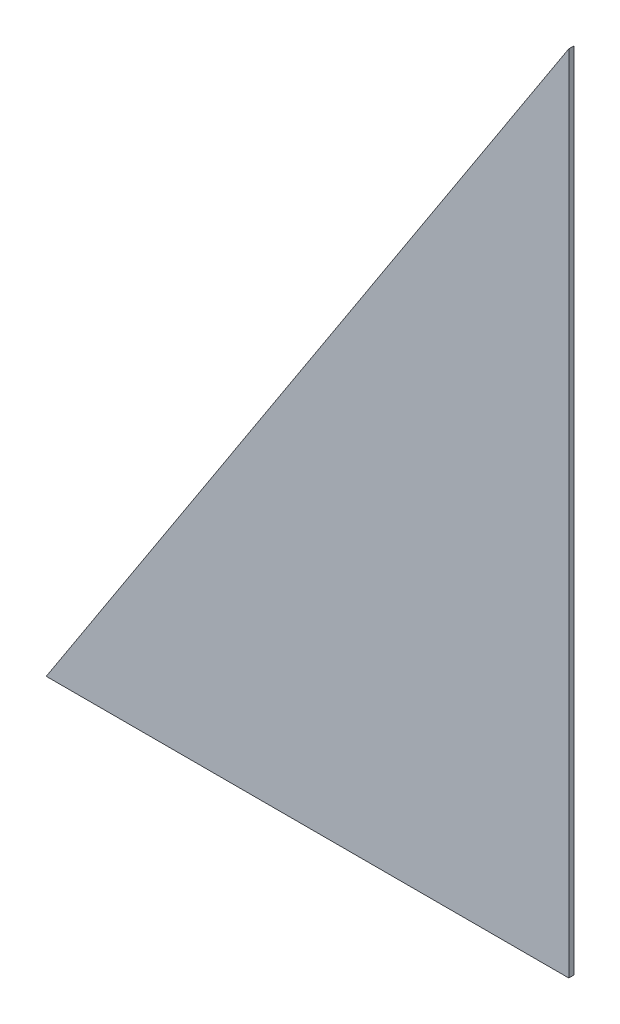
ISO-10303-21;
HEADER;
FILE_DESCRIPTION(('STEP AP214'),'2;1');
FILE_NAME('part.step','',(''),(''),'','','');
FILE_SCHEMA(('AUTOMOTIVE_DESIGN { 1 0 10303 214 1 1 1 1 }'));
ENDSEC;
DATA;
#1=APPLICATION_CONTEXT('core data for automotive mechanical design processes');
#2=APPLICATION_PROTOCOL_DEFINITION('international standard','automotive_design',2000,#1);
#3=PRODUCT_CONTEXT('',#1,'mechanical');
#4=PRODUCT('Part','Part','',(#3));
#5=PRODUCT_RELATED_PRODUCT_CATEGORY('part','',(#4));
#6=PRODUCT_DEFINITION_FORMATION('','',#4);
#7=PRODUCT_DEFINITION_CONTEXT('part definition',#1,'design');
#8=PRODUCT_DEFINITION('design','',#6,#7);
#9=PRODUCT_DEFINITION_SHAPE('','',#8);
#10=(LENGTH_UNIT() NAMED_UNIT(*) SI_UNIT(.MILLI.,.METRE.));
#11=(NAMED_UNIT(*) PLANE_ANGLE_UNIT() SI_UNIT($,.RADIAN.));
#12=(NAMED_UNIT(*) SI_UNIT($,.STERADIAN.) SOLID_ANGLE_UNIT());
#13=UNCERTAINTY_MEASURE_WITH_UNIT(LENGTH_MEASURE(1.E-05),#10,'distance_accuracy_value','');
#14=(GEOMETRIC_REPRESENTATION_CONTEXT(3) GLOBAL_UNCERTAINTY_ASSIGNED_CONTEXT((#13)) GLOBAL_UNIT_ASSIGNED_CONTEXT((#10,
#11,#12)) REPRESENTATION_CONTEXT('',''));
#15=CARTESIAN_POINT('',(0.,0.,0.));
#16=DIRECTION('',(0.,0.,1.));
#17=DIRECTION('',(1.,0.,0.));
#18=AXIS2_PLACEMENT_3D('',#15,#16,#17);
#19=CARTESIAN_POINT('',(0.,0.,0.));
#20=DIRECTION('',(0.,-1.,0.));
#21=DIRECTION('',(1.,0.,0.));
#22=AXIS2_PLACEMENT_3D('',#19,#20,#21);
#23=PLANE('',#22);
#24=DIRECTION('',(-1.,0.,0.));
#25=VECTOR('',#24,1.);
#26=CARTESIAN_POINT('',(0.,0.,1.5875));
#27=LINE('',#26,#25);
#28=CARTESIAN_POINT('',(0.,0.,1.5875));
#29=VERTEX_POINT('',#28);
#30=CARTESIAN_POINT('',(-165.1,0.,1.5875));
#31=VERTEX_POINT('',#30);
#32=EDGE_CURVE('E9',#29,#31,#27,.T.);
#33=ORIENTED_EDGE('',*,*,#32,.T.);
#34=DIRECTION('',(0.,0.,1.));
#35=VECTOR('',#34,1.);
#36=CARTESIAN_POINT('',(-165.1,0.,0.));
#37=LINE('',#36,#35);
#38=CARTESIAN_POINT('',(-165.1,0.,0.));
#39=VERTEX_POINT('',#38);
#40=EDGE_CURVE('E34',#39,#31,#37,.T.);
#41=ORIENTED_EDGE('',*,*,#40,.F.);
#42=DIRECTION('',(-1.,0.,0.));
#43=VECTOR('',#42,1.);
#44=CARTESIAN_POINT('',(0.,0.,0.));
#45=LINE('',#44,#43);
#46=CARTESIAN_POINT('',(0.,0.,0.));
#47=VERTEX_POINT('',#46);
#48=EDGE_CURVE('E54',#47,#39,#45,.T.);
#49=ORIENTED_EDGE('',*,*,#48,.F.);
#50=DIRECTION('',(0.,0.,1.));
#51=VECTOR('',#50,1.);
#52=CARTESIAN_POINT('',(0.,0.,0.));
#53=LINE('',#52,#51);
#54=EDGE_CURVE('E25',#47,#29,#53,.T.);
#55=ORIENTED_EDGE('',*,*,#54,.T.);
#56=EDGE_LOOP('',(#33,#41,#49,#55));
#57=FACE_BOUND('',#56,.T.);
#58=ADVANCED_FACE('F15',(#57),#23,.T.);
#59=CARTESIAN_POINT('',(-165.1,0.,0.));
#60=DIRECTION('',(-0.838670567945424,0.544639035015027,0.));
#61=DIRECTION('',(-0.544639035015027,-0.838670567945424,0.));
#62=AXIS2_PLACEMENT_3D('',#59,#60,#61);
#63=PLANE('',#62);
#64=DIRECTION('',(0.544639035015027,0.838670567945424,0.));
#65=VECTOR('',#64,1.);
#66=CARTESIAN_POINT('',(-165.1,0.,1.5875));
#67=LINE('',#66,#65);
#68=CARTESIAN_POINT('',(0.,254.231705525788,1.5875));
#69=VERTEX_POINT('',#68);
#70=EDGE_CURVE('E58',#31,#69,#67,.T.);
#71=ORIENTED_EDGE('',*,*,#70,.T.);
#72=DIRECTION('',(0.,0.,1.));
#73=VECTOR('',#72,1.);
#74=CARTESIAN_POINT('',(0.,254.231705525788,0.));
#75=LINE('',#74,#73);
#76=CARTESIAN_POINT('',(0.,254.231705525788,0.));
#77=VERTEX_POINT('',#76);
#78=EDGE_CURVE('E48',#77,#69,#75,.T.);
#79=ORIENTED_EDGE('',*,*,#78,.F.);
#80=DIRECTION('',(0.544639035015027,0.838670567945424,0.));
#81=VECTOR('',#80,1.);
#82=CARTESIAN_POINT('',(-165.1,0.,0.));
#83=LINE('',#82,#81);
#84=EDGE_CURVE('E53',#39,#77,#83,.T.);
#85=ORIENTED_EDGE('',*,*,#84,.F.);
#86=ORIENTED_EDGE('',*,*,#40,.T.);
#87=EDGE_LOOP('',(#71,#79,#85,#86));
#88=FACE_BOUND('',#87,.T.);
#89=ADVANCED_FACE('F56',(#88),#63,.T.);
#90=CARTESIAN_POINT('',(0.,254.231705525788,0.));
#91=DIRECTION('',(1.,0.,0.));
#92=DIRECTION('',(0.,1.,0.));
#93=AXIS2_PLACEMENT_3D('',#90,#91,#92);
#94=PLANE('',#93);
#95=DIRECTION('',(0.,-1.,0.));
#96=VECTOR('',#95,1.);
#97=CARTESIAN_POINT('',(0.,254.231705525788,1.5875));
#98=LINE('',#97,#96);
#99=EDGE_CURVE('E60',#69,#29,#98,.T.);
#100=ORIENTED_EDGE('',*,*,#99,.T.);
#101=ORIENTED_EDGE('',*,*,#54,.F.);
#102=DIRECTION('',(0.,-1.,0.));
#103=VECTOR('',#102,1.);
#104=CARTESIAN_POINT('',(0.,254.231705525788,0.));
#105=LINE('',#104,#103);
#106=EDGE_CURVE('E19',#77,#47,#105,.T.);
#107=ORIENTED_EDGE('',*,*,#106,.F.);
#108=ORIENTED_EDGE('',*,*,#78,.T.);
#109=EDGE_LOOP('',(#100,#101,#107,#108));
#110=FACE_BOUND('',#109,.T.);
#111=ADVANCED_FACE('F63',(#110),#94,.T.);
#112=CARTESIAN_POINT('',(-53.5012120045599,98.0670647674538,1.5875));
#113=DIRECTION('',(0.,0.,1.));
#114=DIRECTION('',(1.,0.,0.));
#115=AXIS2_PLACEMENT_3D('',#112,#113,#114);
#116=PLANE('',#115);
#117=ORIENTED_EDGE('',*,*,#32,.F.);
#118=ORIENTED_EDGE('',*,*,#99,.F.);
#119=ORIENTED_EDGE('',*,*,#70,.F.);
#120=EDGE_LOOP('',(#117,#118,#119));
#121=FACE_BOUND('',#120,.T.);
#122=ADVANCED_FACE('F70',(#121),#116,.T.);
#123=CARTESIAN_POINT('',(-53.5012120045599,98.0670647674538,0.));
#124=DIRECTION('',(0.,0.,1.));
#125=DIRECTION('',(1.,0.,0.));
#126=AXIS2_PLACEMENT_3D('',#123,#124,#125);
#127=PLANE('',#126);
#128=ORIENTED_EDGE('',*,*,#106,.T.);
#129=ORIENTED_EDGE('',*,*,#48,.T.);
#130=ORIENTED_EDGE('',*,*,#84,.T.);
#131=EDGE_LOOP('',(#128,#129,#130));
#132=FACE_BOUND('',#131,.T.);
#133=ADVANCED_FACE('F17',(#132),#127,.F.);
#134=CLOSED_SHELL('',(#58,#89,#111,#122,#133));
#135=MANIFOLD_SOLID_BREP('B1',#134);
#136=ADVANCED_BREP_SHAPE_REPRESENTATION('',(#18,#135),#14);
#137=SHAPE_DEFINITION_REPRESENTATION(#9,#136);
ENDSEC;
END-ISO-10303-21;
